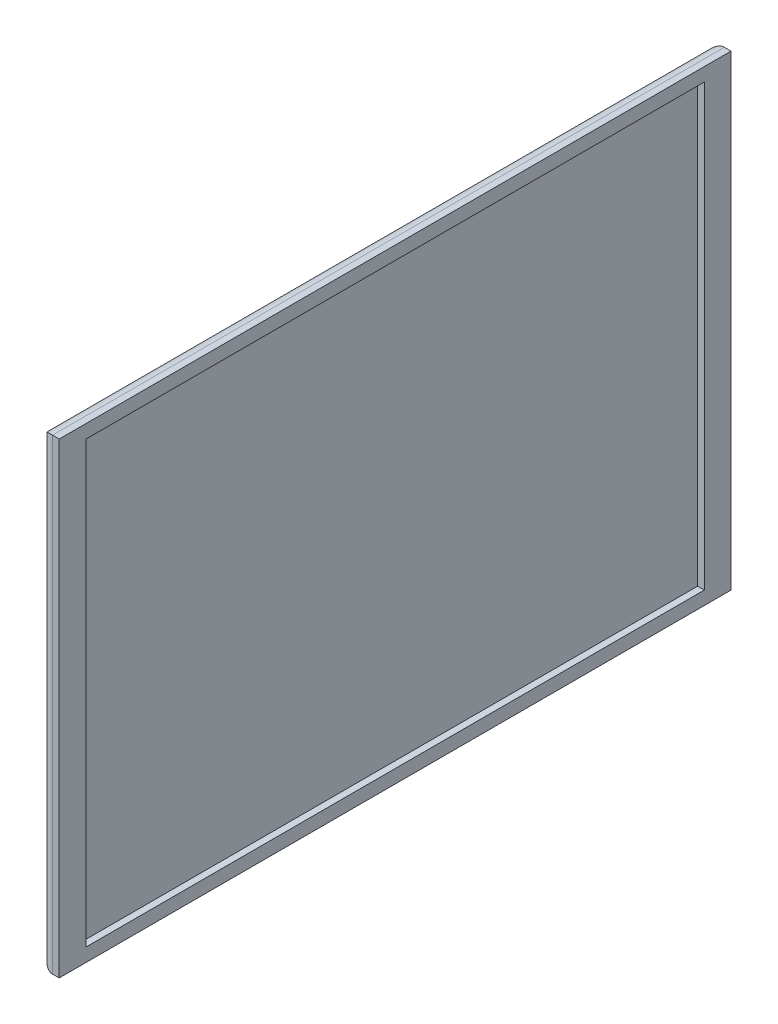
ISO-10303-21;
HEADER;
FILE_DESCRIPTION(('STEP AP214'),'2;1');
FILE_NAME('part.step','',(''),(''),'','','');
FILE_SCHEMA(('AUTOMOTIVE_DESIGN { 1 0 10303 214 1 1 1 1 }'));
ENDSEC;
DATA;
#1=APPLICATION_CONTEXT('core data for automotive mechanical design processes');
#2=APPLICATION_PROTOCOL_DEFINITION('international standard','automotive_design',2000,#1);
#3=PRODUCT_CONTEXT('',#1,'mechanical');
#4=PRODUCT('Part','Part','',(#3));
#5=PRODUCT_RELATED_PRODUCT_CATEGORY('part','',(#4));
#6=PRODUCT_DEFINITION_FORMATION('','',#4);
#7=PRODUCT_DEFINITION_CONTEXT('part definition',#1,'design');
#8=PRODUCT_DEFINITION('design','',#6,#7);
#9=PRODUCT_DEFINITION_SHAPE('','',#8);
#10=(LENGTH_UNIT() NAMED_UNIT(*) SI_UNIT(.MILLI.,.METRE.));
#11=(NAMED_UNIT(*) PLANE_ANGLE_UNIT() SI_UNIT($,.RADIAN.));
#12=(NAMED_UNIT(*) SI_UNIT($,.STERADIAN.) SOLID_ANGLE_UNIT());
#13=UNCERTAINTY_MEASURE_WITH_UNIT(LENGTH_MEASURE(1.E-05),#10,'distance_accuracy_value','');
#14=(GEOMETRIC_REPRESENTATION_CONTEXT(3) GLOBAL_UNCERTAINTY_ASSIGNED_CONTEXT((#13)) GLOBAL_UNIT_ASSIGNED_CONTEXT((#10,
#11,#12)) REPRESENTATION_CONTEXT('',''));
#15=CARTESIAN_POINT('',(0.,0.,0.));
#16=DIRECTION('',(0.,0.,1.));
#17=DIRECTION('',(1.,0.,0.));
#18=AXIS2_PLACEMENT_3D('',#15,#16,#17);
#19=CARTESIAN_POINT('',(5.01123269933213,87.05,-125.3));
#20=DIRECTION('',(0.,0.,1.));
#21=DIRECTION('',(0.,-1.,0.));
#22=AXIS2_PLACEMENT_3D('',#19,#20,#21);
#23=PLANE('',#22);
#24=DIRECTION('',(-1.,0.,0.));
#25=VECTOR('',#24,1.);
#26=CARTESIAN_POINT('',(5.01123269933213,-87.05,-125.3));
#27=LINE('',#26,#25);
#28=CARTESIAN_POINT('',(5.01123269933213,-87.05,-125.3));
#29=VERTEX_POINT('',#28);
#30=CARTESIAN_POINT('',(2.51123269933213,-87.05,-125.3));
#31=VERTEX_POINT('',#30);
#32=EDGE_CURVE('E168',#29,#31,#27,.T.);
#33=ORIENTED_EDGE('',*,*,#32,.T.);
#34=DIRECTION('',(0.,1.,0.));
#35=VECTOR('',#34,1.);
#36=CARTESIAN_POINT('',(2.51123269933213,87.05,-125.3));
#37=LINE('',#36,#35);
#38=CARTESIAN_POINT('',(2.51123269933213,87.05,-125.3));
#39=VERTEX_POINT('',#38);
#40=EDGE_CURVE('E190',#31,#39,#37,.T.);
#41=ORIENTED_EDGE('',*,*,#40,.T.);
#42=DIRECTION('',(-1.,0.,0.));
#43=VECTOR('',#42,1.);
#44=CARTESIAN_POINT('',(5.01123269933213,87.05,-125.3));
#45=LINE('',#44,#43);
#46=CARTESIAN_POINT('',(5.01123269933213,87.05,-125.3));
#47=VERTEX_POINT('',#46);
#48=EDGE_CURVE('E176',#47,#39,#45,.T.);
#49=ORIENTED_EDGE('',*,*,#48,.F.);
#50=DIRECTION('',(0.,1.,0.));
#51=VECTOR('',#50,1.);
#52=CARTESIAN_POINT('',(5.01123269933213,87.05,-125.3));
#53=LINE('',#52,#51);
#54=EDGE_CURVE('E159',#29,#47,#53,.T.);
#55=ORIENTED_EDGE('',*,*,#54,.F.);
#56=EDGE_LOOP('',(#33,#41,#49,#55));
#57=FACE_BOUND('',#56,.T.);
#58=ADVANCED_FACE('F41',(#57),#23,.F.);
#59=CARTESIAN_POINT('',(5.01123269933213,87.05,125.3));
#60=DIRECTION('',(0.,-1.,0.));
#61=DIRECTION('',(0.,0.,-1.));
#62=AXIS2_PLACEMENT_3D('',#59,#60,#61);
#63=PLANE('',#62);
#64=ORIENTED_EDGE('',*,*,#48,.T.);
#65=DIRECTION('',(0.,0.,1.));
#66=VECTOR('',#65,1.);
#67=CARTESIAN_POINT('',(2.51123269933213,87.05,125.3));
#68=LINE('',#67,#66);
#69=CARTESIAN_POINT('',(2.51123269933213,87.05,125.3));
#70=VERTEX_POINT('',#69);
#71=EDGE_CURVE('E12',#39,#70,#68,.T.);
#72=ORIENTED_EDGE('',*,*,#71,.T.);
#73=DIRECTION('',(-1.,0.,0.));
#74=VECTOR('',#73,1.);
#75=CARTESIAN_POINT('',(5.01123269933213,87.05,125.3));
#76=LINE('',#75,#74);
#77=CARTESIAN_POINT('',(5.01123269933213,87.05,125.3));
#78=VERTEX_POINT('',#77);
#79=EDGE_CURVE('E174',#78,#70,#76,.T.);
#80=ORIENTED_EDGE('',*,*,#79,.F.);
#81=DIRECTION('',(0.,0.,1.));
#82=VECTOR('',#81,1.);
#83=CARTESIAN_POINT('',(5.01123269933213,87.05,125.3));
#84=LINE('',#83,#82);
#85=EDGE_CURVE('E162',#47,#78,#84,.T.);
#86=ORIENTED_EDGE('',*,*,#85,.F.);
#87=EDGE_LOOP('',(#64,#72,#80,#86));
#88=FACE_BOUND('',#87,.T.);
#89=ADVANCED_FACE('F231',(#88),#63,.F.);
#90=CARTESIAN_POINT('',(5.01123269933213,87.05,125.3));
#91=DIRECTION('',(0.,0.,-1.));
#92=DIRECTION('',(0.,1.,0.));
#93=AXIS2_PLACEMENT_3D('',#90,#91,#92);
#94=PLANE('',#93);
#95=ORIENTED_EDGE('',*,*,#79,.T.);
#96=DIRECTION('',(0.,-1.,0.));
#97=VECTOR('',#96,1.);
#98=CARTESIAN_POINT('',(2.51123269933213,87.05,125.3));
#99=LINE('',#98,#97);
#100=CARTESIAN_POINT('',(2.51123269933213,-87.05,125.3));
#101=VERTEX_POINT('',#100);
#102=EDGE_CURVE('E50',#70,#101,#99,.T.);
#103=ORIENTED_EDGE('',*,*,#102,.T.);
#104=DIRECTION('',(-1.,0.,0.));
#105=VECTOR('',#104,1.);
#106=CARTESIAN_POINT('',(5.01123269933213,-87.05,125.3));
#107=LINE('',#106,#105);
#108=CARTESIAN_POINT('',(5.01123269933213,-87.05,125.3));
#109=VERTEX_POINT('',#108);
#110=EDGE_CURVE('E171',#109,#101,#107,.T.);
#111=ORIENTED_EDGE('',*,*,#110,.F.);
#112=DIRECTION('',(0.,-1.,0.));
#113=VECTOR('',#112,1.);
#114=CARTESIAN_POINT('',(5.01123269933213,87.05,125.3));
#115=LINE('',#114,#113);
#116=EDGE_CURVE('E164',#78,#109,#115,.T.);
#117=ORIENTED_EDGE('',*,*,#116,.F.);
#118=EDGE_LOOP('',(#95,#103,#111,#117));
#119=FACE_BOUND('',#118,.T.);
#120=ADVANCED_FACE('F230',(#119),#94,.F.);
#121=CARTESIAN_POINT('',(5.01123269933213,-87.05,125.3));
#122=DIRECTION('',(0.,1.,0.));
#123=DIRECTION('',(0.,0.,1.));
#124=AXIS2_PLACEMENT_3D('',#121,#122,#123);
#125=PLANE('',#124);
#126=ORIENTED_EDGE('',*,*,#110,.T.);
#127=DIRECTION('',(0.,0.,-1.));
#128=VECTOR('',#127,1.);
#129=CARTESIAN_POINT('',(2.51123269933213,-87.05,125.3));
#130=LINE('',#129,#128);
#131=EDGE_CURVE('E178',#101,#31,#130,.T.);
#132=ORIENTED_EDGE('',*,*,#131,.T.);
#133=ORIENTED_EDGE('',*,*,#32,.F.);
#134=DIRECTION('',(0.,0.,-1.));
#135=VECTOR('',#134,1.);
#136=CARTESIAN_POINT('',(5.01123269933213,-87.05,125.3));
#137=LINE('',#136,#135);
#138=EDGE_CURVE('E166',#109,#29,#137,.T.);
#139=ORIENTED_EDGE('',*,*,#138,.F.);
#140=EDGE_LOOP('',(#126,#132,#133,#139));
#141=FACE_BOUND('',#140,.T.);
#142=ADVANCED_FACE('F222',(#141),#125,.F.);
#143=CARTESIAN_POINT('',(5.01123269933213,0.,0.));
#144=DIRECTION('',(1.,0.,0.));
#145=DIRECTION('',(0.,0.,-1.));
#146=AXIS2_PLACEMENT_3D('',#143,#144,#145);
#147=PLANE('',#146);
#148=DIRECTION('',(0.,0.,-1.));
#149=VECTOR('',#148,1.);
#150=CARTESIAN_POINT('',(5.01123269933213,-82.05,115.3));
#151=LINE('',#150,#149);
#152=CARTESIAN_POINT('',(5.01123269933213,-82.05,115.3));
#153=VERTEX_POINT('',#152);
#154=CARTESIAN_POINT('',(5.01123269933213,-82.05,-115.3));
#155=VERTEX_POINT('',#154);
#156=EDGE_CURVE('E58',#153,#155,#151,.T.);
#157=ORIENTED_EDGE('',*,*,#156,.F.);
#158=DIRECTION('',(0.,-1.,0.));
#159=VECTOR('',#158,1.);
#160=CARTESIAN_POINT('',(5.01123269933213,82.05,115.3));
#161=LINE('',#160,#159);
#162=CARTESIAN_POINT('',(5.01123269933213,82.05,115.3));
#163=VERTEX_POINT('',#162);
#164=EDGE_CURVE('E140',#163,#153,#161,.T.);
#165=ORIENTED_EDGE('',*,*,#164,.F.);
#166=DIRECTION('',(0.,0.,-1.));
#167=VECTOR('',#166,1.);
#168=CARTESIAN_POINT('',(5.01123269933213,82.05,115.3));
#169=LINE('',#168,#167);
#170=CARTESIAN_POINT('',(5.01123269933213,82.05,-115.3));
#171=VERTEX_POINT('',#170);
#172=EDGE_CURVE('E143',#163,#171,#169,.T.);
#173=ORIENTED_EDGE('',*,*,#172,.T.);
#174=DIRECTION('',(0.,-1.,0.));
#175=VECTOR('',#174,1.);
#176=CARTESIAN_POINT('',(5.01123269933213,82.05,-115.3));
#177=LINE('',#176,#175);
#178=EDGE_CURVE('E149',#171,#155,#177,.T.);
#179=ORIENTED_EDGE('',*,*,#178,.T.);
#180=EDGE_LOOP('',(#157,#165,#173,#179));
#181=FACE_BOUND('',#180,.T.);
#182=ORIENTED_EDGE('',*,*,#54,.T.);
#183=ORIENTED_EDGE('',*,*,#85,.T.);
#184=ORIENTED_EDGE('',*,*,#116,.T.);
#185=ORIENTED_EDGE('',*,*,#138,.T.);
#186=EDGE_LOOP('',(#182,#183,#184,#185));
#187=FACE_BOUND('',#186,.T.);
#188=ADVANCED_FACE('F227',(#181,#187),#147,.T.);
#189=CARTESIAN_POINT('',(-2.48876730066787,0.,0.));
#190=DIRECTION('',(1.,0.,0.));
#191=DIRECTION('',(0.,0.,-1.));
#192=AXIS2_PLACEMENT_3D('',#189,#190,#191);
#193=PLANE('',#192);
#194=DIRECTION('',(0.,1.,0.));
#195=VECTOR('',#194,1.);
#196=CARTESIAN_POINT('',(-2.48876730066787,0.,-120.3));
#197=LINE('',#196,#195);
#198=CARTESIAN_POINT('',(-2.48876730066787,82.05,-120.3));
#199=VERTEX_POINT('',#198);
#200=CARTESIAN_POINT('',(-2.48876730066787,-82.05,-120.3));
#201=VERTEX_POINT('',#200);
#202=EDGE_CURVE('E185',#199,#201,#197,.F.);
#203=ORIENTED_EDGE('',*,*,#202,.T.);
#204=DIRECTION('',(0.,0.,-1.));
#205=VECTOR('',#204,1.);
#206=CARTESIAN_POINT('',(-2.48876730066787,-82.05,0.));
#207=LINE('',#206,#205);
#208=CARTESIAN_POINT('',(-2.48876730066787,-82.05,120.3));
#209=VERTEX_POINT('',#208);
#210=EDGE_CURVE('E187',#201,#209,#207,.F.);
#211=ORIENTED_EDGE('',*,*,#210,.T.);
#212=DIRECTION('',(0.,-1.,0.));
#213=VECTOR('',#212,1.);
#214=CARTESIAN_POINT('',(-2.48876730066787,0.,120.3));
#215=LINE('',#214,#213);
#216=CARTESIAN_POINT('',(-2.48876730066787,82.05,120.3));
#217=VERTEX_POINT('',#216);
#218=EDGE_CURVE('E183',#209,#217,#215,.F.);
#219=ORIENTED_EDGE('',*,*,#218,.T.);
#220=DIRECTION('',(0.,0.,1.));
#221=VECTOR('',#220,1.);
#222=CARTESIAN_POINT('',(-2.48876730066787,82.05,0.));
#223=LINE('',#222,#221);
#224=EDGE_CURVE('E181',#217,#199,#223,.F.);
#225=ORIENTED_EDGE('',*,*,#224,.T.);
#226=EDGE_LOOP('',(#203,#211,#219,#225));
#227=FACE_BOUND('',#226,.T.);
#228=ADVANCED_FACE('F211',(#227),#193,.F.);
#229=CARTESIAN_POINT('',(2.51123269933213,82.05,125.3));
#230=DIRECTION('',(0.,0.,1.));
#231=DIRECTION('',(1.,0.,0.));
#232=AXIS2_PLACEMENT_3D('',#229,#230,#231);
#233=CYLINDRICAL_SURFACE('',#232,5.);
#234=CARTESIAN_POINT('',(2.51123269933213,82.05,-120.3));
#235=DIRECTION('',(0.,0.707106781186547,0.707106781186548));
#236=DIRECTION('',(0.,-0.707106781186548,0.707106781186547));
#237=AXIS2_PLACEMENT_3D('',#234,#235,#236);
#238=ELLIPSE('',#237,7.07106781186547,5.);
#239=EDGE_CURVE('E195',#199,#39,#238,.F.);
#240=ORIENTED_EDGE('',*,*,#239,.F.);
#241=ORIENTED_EDGE('',*,*,#224,.F.);
#242=CARTESIAN_POINT('',(2.51123269933213,82.05,120.3));
#243=DIRECTION('',(0.,-0.707106781186548,0.707106781186547));
#244=DIRECTION('',(0.,0.707106781186547,0.707106781186548));
#245=AXIS2_PLACEMENT_3D('',#242,#243,#244);
#246=ELLIPSE('',#245,7.07106781186548,5.);
#247=EDGE_CURVE('E45',#70,#217,#246,.T.);
#248=ORIENTED_EDGE('',*,*,#247,.F.);
#249=ORIENTED_EDGE('',*,*,#71,.F.);
#250=EDGE_LOOP('',(#240,#241,#248,#249));
#251=FACE_BOUND('',#250,.T.);
#252=ADVANCED_FACE('F43',(#251),#233,.T.);
#253=CARTESIAN_POINT('',(2.51123269933213,87.05,120.3));
#254=DIRECTION('',(0.,-1.,0.));
#255=DIRECTION('',(0.,0.,-1.));
#256=AXIS2_PLACEMENT_3D('',#253,#254,#255);
#257=CYLINDRICAL_SURFACE('',#256,5.);
#258=ORIENTED_EDGE('',*,*,#247,.T.);
#259=ORIENTED_EDGE('',*,*,#218,.F.);
#260=CARTESIAN_POINT('',(2.51123269933213,-82.05,120.3));
#261=DIRECTION('',(0.,-0.707106781186547,-0.707106781186548));
#262=DIRECTION('',(0.,-0.707106781186548,0.707106781186547));
#263=AXIS2_PLACEMENT_3D('',#260,#261,#262);
#264=ELLIPSE('',#263,7.07106781186548,5.);
#265=EDGE_CURVE('E194',#101,#209,#264,.T.);
#266=ORIENTED_EDGE('',*,*,#265,.F.);
#267=ORIENTED_EDGE('',*,*,#102,.F.);
#268=EDGE_LOOP('',(#258,#259,#266,#267));
#269=FACE_BOUND('',#268,.T.);
#270=ADVANCED_FACE('F206',(#269),#257,.T.);
#271=CARTESIAN_POINT('',(2.51123269933213,87.05,-120.3));
#272=DIRECTION('',(0.,1.,0.));
#273=DIRECTION('',(0.,0.,1.));
#274=AXIS2_PLACEMENT_3D('',#271,#272,#273);
#275=CYLINDRICAL_SURFACE('',#274,5.);
#276=ORIENTED_EDGE('',*,*,#239,.T.);
#277=ORIENTED_EDGE('',*,*,#40,.F.);
#278=CARTESIAN_POINT('',(2.51123269933213,-82.05,-120.3));
#279=DIRECTION('',(0.,0.707106781186548,-0.707106781186547));
#280=DIRECTION('',(0.,0.707106781186547,0.707106781186548));
#281=AXIS2_PLACEMENT_3D('',#278,#279,#280);
#282=ELLIPSE('',#281,7.07106781186548,5.);
#283=EDGE_CURVE('E155',#201,#31,#282,.F.);
#284=ORIENTED_EDGE('',*,*,#283,.F.);
#285=ORIENTED_EDGE('',*,*,#202,.F.);
#286=EDGE_LOOP('',(#276,#277,#284,#285));
#287=FACE_BOUND('',#286,.T.);
#288=ADVANCED_FACE('F217',(#287),#275,.T.);
#289=CARTESIAN_POINT('',(2.51123269933213,-82.05,125.3));
#290=DIRECTION('',(0.,0.,-1.));
#291=DIRECTION('',(-1.,0.,0.));
#292=AXIS2_PLACEMENT_3D('',#289,#290,#291);
#293=CYLINDRICAL_SURFACE('',#292,5.);
#294=ORIENTED_EDGE('',*,*,#265,.T.);
#295=ORIENTED_EDGE('',*,*,#210,.F.);
#296=ORIENTED_EDGE('',*,*,#283,.T.);
#297=ORIENTED_EDGE('',*,*,#131,.F.);
#298=EDGE_LOOP('',(#294,#295,#296,#297));
#299=FACE_BOUND('',#298,.T.);
#300=ADVANCED_FACE('F215',(#299),#293,.T.);
#301=CARTESIAN_POINT('',(2.51123269933213,-82.05,115.3));
#302=DIRECTION('',(0.,-1.,0.));
#303=DIRECTION('',(0.,0.,-1.));
#304=AXIS2_PLACEMENT_3D('',#301,#302,#303);
#305=PLANE('',#304);
#306=ORIENTED_EDGE('',*,*,#156,.T.);
#307=DIRECTION('',(1.,0.,0.));
#308=VECTOR('',#307,1.);
#309=CARTESIAN_POINT('',(2.51123269933213,-82.05,-115.3));
#310=LINE('',#309,#308);
#311=CARTESIAN_POINT('',(2.51123269933213,-82.05,-115.3));
#312=VERTEX_POINT('',#311);
#313=EDGE_CURVE('E124',#312,#155,#310,.T.);
#314=ORIENTED_EDGE('',*,*,#313,.F.);
#315=DIRECTION('',(0.,0.,-1.));
#316=VECTOR('',#315,1.);
#317=CARTESIAN_POINT('',(2.51123269933213,-82.05,115.3));
#318=LINE('',#317,#316);
#319=CARTESIAN_POINT('',(2.51123269933213,-82.05,115.3));
#320=VERTEX_POINT('',#319);
#321=EDGE_CURVE('E131',#320,#312,#318,.T.);
#322=ORIENTED_EDGE('',*,*,#321,.F.);
#323=DIRECTION('',(1.,0.,0.));
#324=VECTOR('',#323,1.);
#325=CARTESIAN_POINT('',(2.51123269933213,-82.05,115.3));
#326=LINE('',#325,#324);
#327=EDGE_CURVE('E153',#320,#153,#326,.T.);
#328=ORIENTED_EDGE('',*,*,#327,.T.);
#329=EDGE_LOOP('',(#306,#314,#322,#328));
#330=FACE_BOUND('',#329,.T.);
#331=ADVANCED_FACE('F134',(#330),#305,.F.);
#332=CARTESIAN_POINT('',(2.51123269933213,82.05,115.3));
#333=DIRECTION('',(0.,0.,1.));
#334=DIRECTION('',(1.,0.,0.));
#335=AXIS2_PLACEMENT_3D('',#332,#333,#334);
#336=PLANE('',#335);
#337=ORIENTED_EDGE('',*,*,#164,.T.);
#338=ORIENTED_EDGE('',*,*,#327,.F.);
#339=DIRECTION('',(0.,-1.,0.));
#340=VECTOR('',#339,1.);
#341=CARTESIAN_POINT('',(2.51123269933213,82.05,115.3));
#342=LINE('',#341,#340);
#343=CARTESIAN_POINT('',(2.51123269933213,82.05,115.3));
#344=VERTEX_POINT('',#343);
#345=EDGE_CURVE('E136',#344,#320,#342,.T.);
#346=ORIENTED_EDGE('',*,*,#345,.F.);
#347=DIRECTION('',(1.,0.,0.));
#348=VECTOR('',#347,1.);
#349=CARTESIAN_POINT('',(2.51123269933213,82.05,115.3));
#350=LINE('',#349,#348);
#351=EDGE_CURVE('E156',#344,#163,#350,.T.);
#352=ORIENTED_EDGE('',*,*,#351,.T.);
#353=EDGE_LOOP('',(#337,#338,#346,#352));
#354=FACE_BOUND('',#353,.T.);
#355=ADVANCED_FACE('F314',(#354),#336,.F.);
#356=CARTESIAN_POINT('',(2.51123269933213,82.05,115.3));
#357=DIRECTION('',(0.,-1.,0.));
#358=DIRECTION('',(0.,0.,-1.));
#359=AXIS2_PLACEMENT_3D('',#356,#357,#358);
#360=PLANE('',#359);
#361=ORIENTED_EDGE('',*,*,#172,.F.);
#362=ORIENTED_EDGE('',*,*,#351,.F.);
#363=DIRECTION('',(0.,0.,-1.));
#364=VECTOR('',#363,1.);
#365=CARTESIAN_POINT('',(2.51123269933213,82.05,115.3));
#366=LINE('',#365,#364);
#367=CARTESIAN_POINT('',(2.51123269933213,82.05,-115.3));
#368=VERTEX_POINT('',#367);
#369=EDGE_CURVE('E130',#344,#368,#366,.T.);
#370=ORIENTED_EDGE('',*,*,#369,.T.);
#371=DIRECTION('',(1.,0.,0.));
#372=VECTOR('',#371,1.);
#373=CARTESIAN_POINT('',(2.51123269933213,82.05,-115.3));
#374=LINE('',#373,#372);
#375=EDGE_CURVE('E126',#368,#171,#374,.T.);
#376=ORIENTED_EDGE('',*,*,#375,.T.);
#377=EDGE_LOOP('',(#361,#362,#370,#376));
#378=FACE_BOUND('',#377,.T.);
#379=ADVANCED_FACE('F320',(#378),#360,.T.);
#380=CARTESIAN_POINT('',(2.51123269933213,82.05,-115.3));
#381=DIRECTION('',(0.,0.,1.));
#382=DIRECTION('',(1.,0.,0.));
#383=AXIS2_PLACEMENT_3D('',#380,#381,#382);
#384=PLANE('',#383);
#385=ORIENTED_EDGE('',*,*,#178,.F.);
#386=ORIENTED_EDGE('',*,*,#375,.F.);
#387=DIRECTION('',(0.,-1.,0.));
#388=VECTOR('',#387,1.);
#389=CARTESIAN_POINT('',(2.51123269933213,82.05,-115.3));
#390=LINE('',#389,#388);
#391=EDGE_CURVE('E121',#368,#312,#390,.T.);
#392=ORIENTED_EDGE('',*,*,#391,.T.);
#393=ORIENTED_EDGE('',*,*,#313,.T.);
#394=EDGE_LOOP('',(#385,#386,#392,#393));
#395=FACE_BOUND('',#394,.T.);
#396=ADVANCED_FACE('F123',(#395),#384,.T.);
#397=CARTESIAN_POINT('',(2.51123269933213,0.,0.));
#398=DIRECTION('',(-1.,0.,0.));
#399=DIRECTION('',(0.,0.,1.));
#400=AXIS2_PLACEMENT_3D('',#397,#398,#399);
#401=PLANE('',#400);
#402=ORIENTED_EDGE('',*,*,#321,.T.);
#403=ORIENTED_EDGE('',*,*,#391,.F.);
#404=ORIENTED_EDGE('',*,*,#369,.F.);
#405=ORIENTED_EDGE('',*,*,#345,.T.);
#406=EDGE_LOOP('',(#402,#403,#404,#405));
#407=FACE_BOUND('',#406,.T.);
#408=ADVANCED_FACE('F138',(#407),#401,.F.);
#409=CLOSED_SHELL('',(#58,#89,#120,#142,#188,#228,#252,#270,#288,#300,#331,#355,#379,#396,#408));
#410=MANIFOLD_SOLID_BREP('B2',#409);
#411=ADVANCED_BREP_SHAPE_REPRESENTATION('',(#18,#410),#14);
#412=SHAPE_DEFINITION_REPRESENTATION(#9,#411);
ENDSEC;
END-ISO-10303-21;
